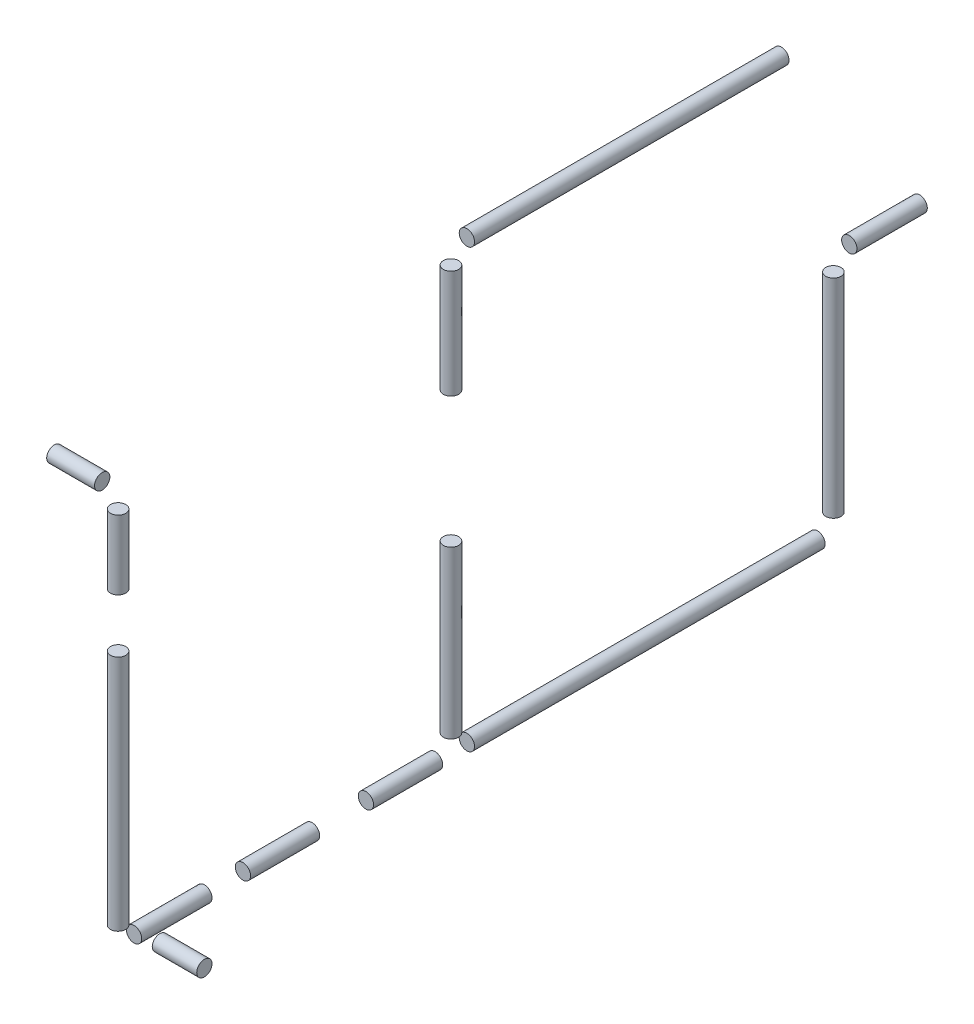
ISO-10303-21;
HEADER;
FILE_DESCRIPTION(('STEP AP214'),'2;1');
FILE_NAME('part.step','',(''),(''),'','','');
FILE_SCHEMA(('AUTOMOTIVE_DESIGN { 1 0 10303 214 1 1 1 1 }'));
ENDSEC;
DATA;
#1=APPLICATION_CONTEXT('core data for automotive mechanical design processes');
#2=APPLICATION_PROTOCOL_DEFINITION('international standard','automotive_design',2000,#1);
#3=PRODUCT_CONTEXT('',#1,'mechanical');
#4=PRODUCT('Part','Part','',(#3));
#5=PRODUCT_RELATED_PRODUCT_CATEGORY('part','',(#4));
#6=PRODUCT_DEFINITION_FORMATION('','',#4);
#7=PRODUCT_DEFINITION_CONTEXT('part definition',#1,'design');
#8=PRODUCT_DEFINITION('design','',#6,#7);
#9=PRODUCT_DEFINITION_SHAPE('','',#8);
#10=(LENGTH_UNIT() NAMED_UNIT(*) SI_UNIT(.MILLI.,.METRE.));
#11=(NAMED_UNIT(*) PLANE_ANGLE_UNIT() SI_UNIT($,.RADIAN.));
#12=(NAMED_UNIT(*) SI_UNIT($,.STERADIAN.) SOLID_ANGLE_UNIT());
#13=UNCERTAINTY_MEASURE_WITH_UNIT(LENGTH_MEASURE(1.E-05),#10,'distance_accuracy_value','');
#14=(GEOMETRIC_REPRESENTATION_CONTEXT(3) GLOBAL_UNCERTAINTY_ASSIGNED_CONTEXT((#13)) GLOBAL_UNIT_ASSIGNED_CONTEXT((#10,
#11,#12)) REPRESENTATION_CONTEXT('',''));
#15=CARTESIAN_POINT('',(0.,0.,0.));
#16=DIRECTION('',(0.,0.,1.));
#17=DIRECTION('',(1.,0.,0.));
#18=AXIS2_PLACEMENT_3D('',#15,#16,#17);
#19=CARTESIAN_POINT('',(-106.981509373988,-37.1926464369301,527.791901869104));
#20=DIRECTION('',(1.,0.,0.));
#21=DIRECTION('',(0.,0.,-1.));
#22=AXIS2_PLACEMENT_3D('',#19,#20,#21);
#23=CYLINDRICAL_SURFACE('',#22,6.35000000036741);
#24=CARTESIAN_POINT('',(-89.0209971308104,-37.1926464369301,527.791901869104));
#25=DIRECTION('',(1.,0.,0.));
#26=DIRECTION('',(0.,1.,0.));
#27=AXIS2_PLACEMENT_3D('',#24,#25,#26);
#28=CIRCLE('',#27,6.35000000036741);
#29=CARTESIAN_POINT('',(-89.0209971308104,-30.8426464365627,527.791901869104));
#30=VERTEX_POINT('',#29);
#31=EDGE_CURVE('E11',#30,#30,#28,.F.);
#32=ORIENTED_EDGE('',*,*,#31,.F.);
#33=EDGE_LOOP('',(#32));
#34=FACE_BOUND('',#33,.T.);
#35=CARTESIAN_POINT('',(-49.2760000000003,-37.1926464369301,527.791901869104));
#36=DIRECTION('',(1.,0.,0.));
#37=DIRECTION('',(0.,0.,-1.));
#38=AXIS2_PLACEMENT_3D('',#35,#36,#37);
#39=CIRCLE('',#38,6.35000000036741);
#40=CARTESIAN_POINT('',(-49.2760000000003,-37.1926464369301,521.441901868736));
#41=VERTEX_POINT('',#40);
#42=EDGE_CURVE('E52',#41,#41,#39,.T.);
#43=ORIENTED_EDGE('',*,*,#42,.F.);
#44=EDGE_LOOP('',(#43));
#45=FACE_BOUND('',#44,.T.);
#46=ADVANCED_FACE('F46',(#34,#45),#23,.T.);
#47=CARTESIAN_POINT('',(-49.2760000000003,-37.1926464369301,527.791901869104));
#48=DIRECTION('',(1.,0.,0.));
#49=DIRECTION('',(0.,0.,-1.));
#50=AXIS2_PLACEMENT_3D('',#47,#48,#49);
#51=PLANE('',#50);
#52=ORIENTED_EDGE('',*,*,#42,.T.);
#53=EDGE_LOOP('',(#52));
#54=FACE_BOUND('',#53,.T.);
#55=ADVANCED_FACE('F58',(#54),#51,.T.);
#56=CARTESIAN_POINT('',(-89.0209971308104,0.,0.));
#57=DIRECTION('',(1.,0.,0.));
#58=DIRECTION('',(0.,1.,0.));
#59=AXIS2_PLACEMENT_3D('',#56,#57,#58);
#60=PLANE('',#59);
#61=ORIENTED_EDGE('',*,*,#31,.T.);
#62=EDGE_LOOP('',(#61));
#63=FACE_BOUND('',#62,.T.);
#64=ADVANCED_FACE('F65',(#63),#60,.F.);
#65=CLOSED_SHELL('',(#46,#55,#64));
#66=MANIFOLD_SOLID_BREP('B2',#65);
#67=CARTESIAN_POINT('',(-36.0679999999031,-32.4401341947649,527.791901869104));
#68=DIRECTION('',(0.,-1.,0.));
#69=DIRECTION('',(1.,0.,0.));
#70=AXIS2_PLACEMENT_3D('',#67,#68,#69);
#71=CYLINDRICAL_SURFACE('',#70,6.3499999999807);
#72=CARTESIAN_POINT('',(-36.0679999999031,-107.804646436848,527.791901869104));
#73=DIRECTION('',(0.,1.,0.));
#74=DIRECTION('',(-1.,0.,0.));
#75=AXIS2_PLACEMENT_3D('',#72,#73,#74);
#76=CIRCLE('',#75,6.3499999999807);
#77=CARTESIAN_POINT('',(-42.4179999998838,-107.804646436848,527.791901869104));
#78=VERTEX_POINT('',#77);
#79=EDGE_CURVE('E102',#78,#78,#76,.T.);
#80=ORIENTED_EDGE('',*,*,#79,.T.);
#81=EDGE_LOOP('',(#80));
#82=FACE_BOUND('',#81,.T.);
#83=CARTESIAN_POINT('',(-36.0679999999031,-50.4006464368485,527.791901869104));
#84=DIRECTION('',(0.,1.,0.));
#85=DIRECTION('',(0.,0.,1.));
#86=AXIS2_PLACEMENT_3D('',#83,#84,#85);
#87=CIRCLE('',#86,6.3499999999807);
#88=CARTESIAN_POINT('',(-36.0679999999031,-50.4006464368485,534.141901869084));
#89=VERTEX_POINT('',#88);
#90=EDGE_CURVE('E45',#89,#89,#87,.T.);
#91=ORIENTED_EDGE('',*,*,#90,.F.);
#92=EDGE_LOOP('',(#91));
#93=FACE_BOUND('',#92,.T.);
#94=ADVANCED_FACE('F95',(#82,#93),#71,.T.);
#95=CARTESIAN_POINT('',(-36.0679999999031,-107.804646436848,527.791901869104));
#96=DIRECTION('',(0.,1.,0.));
#97=DIRECTION('',(-1.,0.,0.));
#98=AXIS2_PLACEMENT_3D('',#95,#96,#97);
#99=PLANE('',#98);
#100=ORIENTED_EDGE('',*,*,#79,.F.);
#101=EDGE_LOOP('',(#100));
#102=FACE_BOUND('',#101,.T.);
#103=ADVANCED_FACE('F110',(#102),#99,.F.);
#104=CARTESIAN_POINT('',(5.69656620990656E-11,-50.4006464368485,0.));
#105=DIRECTION('',(0.,1.,0.));
#106=DIRECTION('',(0.,0.,1.));
#107=AXIS2_PLACEMENT_3D('',#104,#105,#106);
#108=PLANE('',#107);
#109=ORIENTED_EDGE('',*,*,#90,.T.);
#110=EDGE_LOOP('',(#109));
#111=FACE_BOUND('',#110,.T.);
#112=ADVANCED_FACE('F97',(#111),#108,.T.);
#113=CLOSED_SHELL('',(#94,#103,#112));
#114=MANIFOLD_SOLID_BREP('B6',#113);
#115=CARTESIAN_POINT('',(-36.0679999996054,-349.612646436849,527.791901869104));
#116=DIRECTION('',(0.,1.,0.));
#117=DIRECTION('',(0.,0.,1.));
#118=AXIS2_PLACEMENT_3D('',#115,#116,#117);
#119=PLANE('',#118);
#120=CARTESIAN_POINT('',(-36.0679999996054,-349.612646436849,527.791901869104));
#121=DIRECTION('',(0.,1.,0.));
#122=DIRECTION('',(0.,0.,1.));
#123=AXIS2_PLACEMENT_3D('',#120,#121,#122);
#124=CIRCLE('',#123,6.34999999998065);
#125=CARTESIAN_POINT('',(-36.0679999996054,-349.612646436849,534.141901869084));
#126=VERTEX_POINT('',#125);
#127=EDGE_CURVE('E151',#126,#126,#124,.T.);
#128=ORIENTED_EDGE('',*,*,#127,.F.);
#129=EDGE_LOOP('',(#128));
#130=FACE_BOUND('',#129,.T.);
#131=ADVANCED_FACE('F144',(#130),#119,.F.);
#132=CARTESIAN_POINT('',(-36.0679999996054,-134.548134194765,527.791901869104));
#133=DIRECTION('',(0.,-1.,0.));
#134=DIRECTION('',(0.,0.,-1.));
#135=AXIS2_PLACEMENT_3D('',#132,#133,#134);
#136=CYLINDRICAL_SURFACE('',#135,6.34999999998065);
#137=CARTESIAN_POINT('',(-36.0679999996054,-152.508646436849,527.791901869104));
#138=DIRECTION('',(0.,-1.,0.));
#139=DIRECTION('',(0.,0.,-1.));
#140=AXIS2_PLACEMENT_3D('',#137,#138,#139);
#141=CIRCLE('',#140,6.34999999998065);
#142=CARTESIAN_POINT('',(-36.0679999996054,-152.508646436849,521.441901869123));
#143=VERTEX_POINT('',#142);
#144=EDGE_CURVE('E94',#143,#143,#141,.T.);
#145=ORIENTED_EDGE('',*,*,#144,.T.);
#146=EDGE_LOOP('',(#145));
#147=FACE_BOUND('',#146,.T.);
#148=ORIENTED_EDGE('',*,*,#127,.T.);
#149=EDGE_LOOP('',(#148));
#150=FACE_BOUND('',#149,.T.);
#151=ADVANCED_FACE('F146',(#147,#150),#136,.T.);
#152=CARTESIAN_POINT('',(1.7230553522848E-10,-152.508646436849,0.));
#153=DIRECTION('',(0.,-1.,0.));
#154=DIRECTION('',(0.,0.,-1.));
#155=AXIS2_PLACEMENT_3D('',#152,#153,#154);
#156=PLANE('',#155);
#157=ORIENTED_EDGE('',*,*,#144,.F.);
#158=EDGE_LOOP('',(#157));
#159=FACE_BOUND('',#158,.T.);
#160=ADVANCED_FACE('F162',(#159),#156,.F.);
#161=CLOSED_SHELL('',(#131,#151,#160));
#162=MANIFOLD_SOLID_BREP('B40',#161);
#163=CARTESIAN_POINT('',(-36.0679999995904,-362.820646436889,532.544414112398));
#164=DIRECTION('',(0.,0.,-1.));
#165=DIRECTION('',(-1.,0.,0.));
#166=AXIS2_PLACEMENT_3D('',#163,#164,#165);
#167=CYLINDRICAL_SURFACE('',#166,6.35000000040867);
#168=CARTESIAN_POINT('',(-36.0679999995904,-362.820646436889,456.163901869103));
#169=DIRECTION('',(0.,0.,1.));
#170=DIRECTION('',(1.,0.,0.));
#171=AXIS2_PLACEMENT_3D('',#168,#169,#170);
#172=CIRCLE('',#171,6.35000000040867);
#173=CARTESIAN_POINT('',(-42.4179999999991,-362.820646436889,456.163901869103));
#174=VERTEX_POINT('',#173);
#175=EDGE_CURVE('E200',#174,#174,#172,.T.);
#176=CARTESIAN_POINT('',(-36.0679999995904,-362.820646436889,514.583901869103));
#177=DIRECTION('',(0.,0.,1.));
#178=DIRECTION('',(1.,0.,0.));
#179=AXIS2_PLACEMENT_3D('',#176,#177,#178);
#180=CIRCLE('',#179,6.35000000040867);
#181=CARTESIAN_POINT('',(-42.4179999999991,-362.820646436889,514.583901869103));
#182=VERTEX_POINT('',#181);
#183=EDGE_CURVE('E143',#182,#182,#180,.T.);
#184=CARTESIAN_POINT('',(-42.4179999999991,-362.820646436889,456.163901869103));
#185=CARTESIAN_POINT('',(-42.4179999999991,-362.820646436889,456.77244353577));
#186=CARTESIAN_POINT('',(-42.4179999999991,-362.820646436889,457.380985202437));
#187=CARTESIAN_POINT('',(-42.4179999999991,-362.820646436889,458.59806853577));
#188=CARTESIAN_POINT('',(-42.4179999999991,-362.820646436889,459.206610202437));
#189=CARTESIAN_POINT('',(-42.4179999999991,-362.820646436889,460.42369353577));
#190=CARTESIAN_POINT('',(-42.4179999999991,-362.820646436889,461.032235202437));
#191=CARTESIAN_POINT('',(-42.4179999999991,-362.820646436889,462.24931853577));
#192=CARTESIAN_POINT('',(-42.4179999999991,-362.820646436889,462.857860202437));
#193=CARTESIAN_POINT('',(-42.4179999999991,-362.820646436889,464.07494353577));
#194=CARTESIAN_POINT('',(-42.4179999999991,-362.820646436889,464.683485202437));
#195=CARTESIAN_POINT('',(-42.4179999999991,-362.820646436889,465.90056853577));
#196=CARTESIAN_POINT('',(-42.4179999999991,-362.820646436889,466.509110202437));
#197=CARTESIAN_POINT('',(-42.4179999999991,-362.820646436889,467.72619353577));
#198=CARTESIAN_POINT('',(-42.4179999999991,-362.820646436889,468.334735202437));
#199=CARTESIAN_POINT('',(-42.4179999999991,-362.820646436889,469.55181853577));
#200=CARTESIAN_POINT('',(-42.4179999999991,-362.820646436889,470.160360202437));
#201=CARTESIAN_POINT('',(-42.4179999999991,-362.820646436889,471.37744353577));
#202=CARTESIAN_POINT('',(-42.4179999999991,-362.820646436889,471.985985202437));
#203=CARTESIAN_POINT('',(-42.4179999999991,-362.820646436889,473.20306853577));
#204=CARTESIAN_POINT('',(-42.4179999999991,-362.820646436889,473.811610202437));
#205=CARTESIAN_POINT('',(-42.4179999999991,-362.820646436889,475.02869353577));
#206=CARTESIAN_POINT('',(-42.4179999999991,-362.820646436889,475.637235202437));
#207=CARTESIAN_POINT('',(-42.4179999999991,-362.820646436889,476.85431853577));
#208=CARTESIAN_POINT('',(-42.4179999999991,-362.820646436889,477.462860202437));
#209=CARTESIAN_POINT('',(-42.4179999999991,-362.820646436889,478.67994353577));
#210=CARTESIAN_POINT('',(-42.4179999999991,-362.820646436889,479.288485202437));
#211=CARTESIAN_POINT('',(-42.4179999999991,-362.820646436889,480.50556853577));
#212=CARTESIAN_POINT('',(-42.4179999999991,-362.820646436889,481.114110202437));
#213=CARTESIAN_POINT('',(-42.4179999999991,-362.820646436889,482.33119353577));
#214=CARTESIAN_POINT('',(-42.4179999999991,-362.820646436889,482.939735202437));
#215=CARTESIAN_POINT('',(-42.4179999999991,-362.820646436889,484.15681853577));
#216=CARTESIAN_POINT('',(-42.4179999999991,-362.820646436889,484.765360202437));
#217=CARTESIAN_POINT('',(-42.4179999999991,-362.820646436889,485.98244353577));
#218=CARTESIAN_POINT('',(-42.4179999999991,-362.820646436889,486.590985202437));
#219=CARTESIAN_POINT('',(-42.4179999999991,-362.820646436889,487.80806853577));
#220=CARTESIAN_POINT('',(-42.4179999999991,-362.820646436889,488.416610202437));
#221=CARTESIAN_POINT('',(-42.4179999999991,-362.820646436889,489.63369353577));
#222=CARTESIAN_POINT('',(-42.4179999999991,-362.820646436889,490.242235202437));
#223=CARTESIAN_POINT('',(-42.4179999999991,-362.820646436889,491.45931853577));
#224=CARTESIAN_POINT('',(-42.4179999999991,-362.820646436889,492.067860202437));
#225=CARTESIAN_POINT('',(-42.4179999999991,-362.820646436889,493.28494353577));
#226=CARTESIAN_POINT('',(-42.4179999999991,-362.820646436889,493.893485202437));
#227=CARTESIAN_POINT('',(-42.4179999999991,-362.820646436889,495.11056853577));
#228=CARTESIAN_POINT('',(-42.4179999999991,-362.820646436889,495.719110202437));
#229=CARTESIAN_POINT('',(-42.4179999999991,-362.820646436889,496.93619353577));
#230=CARTESIAN_POINT('',(-42.4179999999991,-362.820646436889,497.544735202437));
#231=CARTESIAN_POINT('',(-42.4179999999991,-362.820646436889,498.76181853577));
#232=CARTESIAN_POINT('',(-42.4179999999991,-362.820646436889,499.370360202437));
#233=CARTESIAN_POINT('',(-42.4179999999991,-362.820646436889,500.58744353577));
#234=CARTESIAN_POINT('',(-42.4179999999991,-362.820646436889,501.195985202437));
#235=CARTESIAN_POINT('',(-42.4179999999991,-362.820646436889,502.41306853577));
#236=CARTESIAN_POINT('',(-42.4179999999991,-362.820646436889,503.021610202437));
#237=CARTESIAN_POINT('',(-42.4179999999991,-362.820646436889,504.23869353577));
#238=CARTESIAN_POINT('',(-42.4179999999991,-362.820646436889,504.847235202437));
#239=CARTESIAN_POINT('',(-42.4179999999991,-362.820646436889,506.06431853577));
#240=CARTESIAN_POINT('',(-42.4179999999991,-362.820646436889,506.672860202437));
#241=CARTESIAN_POINT('',(-42.4179999999991,-362.820646436889,507.88994353577));
#242=CARTESIAN_POINT('',(-42.4179999999991,-362.820646436889,508.498485202437));
#243=CARTESIAN_POINT('',(-42.4179999999991,-362.820646436889,509.71556853577));
#244=CARTESIAN_POINT('',(-42.4179999999991,-362.820646436889,510.324110202437));
#245=CARTESIAN_POINT('',(-42.4179999999991,-362.820646436889,511.54119353577));
#246=CARTESIAN_POINT('',(-42.4179999999991,-362.820646436889,512.149735202437));
#247=CARTESIAN_POINT('',(-42.4179999999991,-362.820646436889,513.36681853577));
#248=CARTESIAN_POINT('',(-42.4179999999991,-362.820646436889,513.975360202437));
#249=CARTESIAN_POINT('',(-42.4179999999991,-362.820646436889,514.583901869103));
#250=B_SPLINE_CURVE_WITH_KNOTS('',3,(#184,#185,#186,#187,#188,#189,#190,#191,#192,#193,#194,
#195,#196,#197,#198,#199,#200,#201,#202,#203,#204,#205,#206,#207,#208,#209,#210,#211,#212,#213,
#214,#215,#216,#217,#218,#219,#220,#221,#222,#223,#224,#225,#226,#227,#228,#229,#230,#231,#232,
#233,#234,#235,#236,#237,#238,#239,#240,#241,#242,#243,#244,#245,#246,#247,#248,#249),
.UNSPECIFIED.,.F.,.F.,(4,2,2,2,2,2,2,2,2,2,2,2,2,2,2,2,2,2,2,2,2,2,2,2,2,2,2,2,2,2,2,2,4),(0.,
1.825625,3.65124999999999,5.47687499999999,7.30250000000004,9.12812499999999,10.95375,12.779375,
14.605,16.430625,18.25625,20.081875,21.9075,23.733125,25.55875,27.384375,29.21,31.035625,
32.86125,34.686875,36.5125,38.338125,40.16375,41.9893750000001,43.815,45.640625,47.46625,
49.291875,51.1175,52.943125,54.76875,56.594375,58.42),.UNSPECIFIED.);
#251=EDGE_CURVE('BSEAM193',#174,#182,#250,.T.);
#252=ORIENTED_EDGE('',*,*,#175,.T.);
#253=ORIENTED_EDGE('',*,*,#183,.F.);
#254=ORIENTED_EDGE('',*,*,#251,.T.);
#255=ORIENTED_EDGE('',*,*,#251,.F.);
#256=EDGE_LOOP('',(#252,#254,#253,#255));
#257=FACE_BOUND('',#256,.T.);
#258=ADVANCED_FACE('F193',(#257),#167,.T.);
#259=CARTESIAN_POINT('',(-36.0679999995904,-362.820646436889,456.163901869103));
#260=DIRECTION('',(0.,0.,1.));
#261=DIRECTION('',(1.,0.,0.));
#262=AXIS2_PLACEMENT_3D('',#259,#260,#261);
#263=PLANE('',#262);
#264=ORIENTED_EDGE('',*,*,#175,.F.);
#265=EDGE_LOOP('',(#264));
#266=FACE_BOUND('',#265,.T.);
#267=ADVANCED_FACE('F208',(#266),#263,.F.);
#268=CARTESIAN_POINT('',(0.,0.,514.583901869103));
#269=DIRECTION('',(0.,0.,1.));
#270=DIRECTION('',(1.,0.,0.));
#271=AXIS2_PLACEMENT_3D('',#268,#269,#270);
#272=PLANE('',#271);
#273=ORIENTED_EDGE('',*,*,#183,.T.);
#274=EDGE_LOOP('',(#273));
#275=FACE_BOUND('',#274,.T.);
#276=ADVANCED_FACE('F195',(#275),#272,.T.);
#277=CLOSED_SHELL('',(#258,#267,#276));
#278=MANIFOLD_SOLID_BREP('B89',#277);
#279=CARTESIAN_POINT('',(-34.1094877568232,-432.403946436949,440.161901869103));
#280=DIRECTION('',(-1.,0.,0.));
#281=DIRECTION('',(0.,0.,1.));
#282=AXIS2_PLACEMENT_3D('',#279,#280,#281);
#283=CYLINDRICAL_SURFACE('',#282,6.35000000036717);
#284=CARTESIAN_POINT('',(-89.0209971308574,-432.403946436949,440.161901869103));
#285=DIRECTION('',(1.,0.,0.));
#286=DIRECTION('',(0.,0.,-1.));
#287=AXIS2_PLACEMENT_3D('',#284,#285,#286);
#288=CIRCLE('',#287,6.35000000036717);
#289=CARTESIAN_POINT('',(-89.0209971308574,-432.403946436949,446.511901869471));
#290=VERTEX_POINT('',#289);
#291=EDGE_CURVE('E249',#290,#290,#288,.T.);
#292=CARTESIAN_POINT('',(-52.0700000000001,-432.403946436949,440.161901869103));
#293=DIRECTION('',(1.,0.,0.));
#294=DIRECTION('',(0.,1.,0.));
#295=AXIS2_PLACEMENT_3D('',#292,#293,#294);
#296=CIRCLE('',#295,6.35000000036717);
#297=CARTESIAN_POINT('',(-52.0700000000001,-432.403946436949,446.511901869471));
#298=VERTEX_POINT('',#297);
#299=EDGE_CURVE('E192',#298,#298,#296,.T.);
#300=CARTESIAN_POINT('',(-89.0209971308574,-432.403946436949,446.511901869471));
#301=CARTESIAN_POINT('',(-88.6360909107443,-432.403946436949,446.511901869471));
#302=CARTESIAN_POINT('',(-88.2511846906312,-432.403946436949,446.511901869471));
#303=CARTESIAN_POINT('',(-87.481372250405,-432.403946436949,446.511901869471));
#304=CARTESIAN_POINT('',(-87.0964660302919,-432.403946436949,446.511901869471));
#305=CARTESIAN_POINT('',(-86.3266535900657,-432.403946436949,446.511901869471));
#306=CARTESIAN_POINT('',(-85.9417473699526,-432.403946436949,446.511901869471));
#307=CARTESIAN_POINT('',(-85.1719349297264,-432.403946436949,446.511901869471));
#308=CARTESIAN_POINT('',(-84.7870287096133,-432.403946436949,446.511901869471));
#309=CARTESIAN_POINT('',(-84.0172162693871,-432.403946436949,446.511901869471));
#310=CARTESIAN_POINT('',(-83.632310049274,-432.403946436949,446.511901869471));
#311=CARTESIAN_POINT('',(-82.8624976090478,-432.403946436949,446.511901869471));
#312=CARTESIAN_POINT('',(-82.4775913889347,-432.403946436949,446.511901869471));
#313=CARTESIAN_POINT('',(-81.7077789487085,-432.403946436949,446.511901869471));
#314=CARTESIAN_POINT('',(-81.3228727285954,-432.403946436949,446.511901869471));
#315=CARTESIAN_POINT('',(-80.5530602883692,-432.403946436949,446.511901869471));
#316=CARTESIAN_POINT('',(-80.1681540682562,-432.403946436949,446.511901869471));
#317=CARTESIAN_POINT('',(-79.39834162803,-432.403946436949,446.511901869471));
#318=CARTESIAN_POINT('',(-79.0134354079168,-432.403946436949,446.511901869471));
#319=CARTESIAN_POINT('',(-78.2436229676907,-432.403946436949,446.511901869471));
#320=CARTESIAN_POINT('',(-77.8587167475776,-432.403946436949,446.511901869471));
#321=CARTESIAN_POINT('',(-77.0889043073514,-432.403946436949,446.511901869471));
#322=CARTESIAN_POINT('',(-76.7039980872383,-432.403946436949,446.511901869471));
#323=CARTESIAN_POINT('',(-75.9341856470121,-432.403946436949,446.511901869471));
#324=CARTESIAN_POINT('',(-75.549279426899,-432.403946436949,446.511901869471));
#325=CARTESIAN_POINT('',(-74.7794669866728,-432.403946436949,446.511901869471));
#326=CARTESIAN_POINT('',(-74.3945607665597,-432.403946436949,446.511901869471));
#327=CARTESIAN_POINT('',(-73.6247483263335,-432.403946436949,446.511901869471));
#328=CARTESIAN_POINT('',(-73.2398421062204,-432.403946436949,446.511901869471));
#329=CARTESIAN_POINT('',(-72.4700296659942,-432.403946436949,446.511901869471));
#330=CARTESIAN_POINT('',(-72.0851234458811,-432.403946436949,446.511901869471));
#331=CARTESIAN_POINT('',(-71.3153110056549,-432.403946436949,446.511901869471));
#332=CARTESIAN_POINT('',(-70.9304047855418,-432.403946436949,446.511901869471));
#333=CARTESIAN_POINT('',(-70.1605923453156,-432.403946436949,446.511901869471));
#334=CARTESIAN_POINT('',(-69.7756861252025,-432.403946436949,446.511901869471));
#335=CARTESIAN_POINT('',(-69.0058736849763,-432.403946436949,446.511901869471));
#336=CARTESIAN_POINT('',(-68.6209674648632,-432.403946436949,446.511901869471));
#337=CARTESIAN_POINT('',(-67.851155024637,-432.403946436949,446.511901869471));
#338=CARTESIAN_POINT('',(-67.4662488045239,-432.403946436949,446.511901869471));
#339=CARTESIAN_POINT('',(-66.6964363642977,-432.403946436949,446.511901869471));
#340=CARTESIAN_POINT('',(-66.3115301441847,-432.403946436949,446.511901869471));
#341=CARTESIAN_POINT('',(-65.5417177039585,-432.403946436949,446.511901869471));
#342=CARTESIAN_POINT('',(-65.1568114838454,-432.403946436949,446.511901869471));
#343=CARTESIAN_POINT('',(-64.3869990436192,-432.403946436949,446.511901869471));
#344=CARTESIAN_POINT('',(-64.0020928235061,-432.403946436949,446.511901869471));
#345=CARTESIAN_POINT('',(-63.2322803832799,-432.403946436949,446.511901869471));
#346=CARTESIAN_POINT('',(-62.8473741631668,-432.403946436949,446.511901869471));
#347=CARTESIAN_POINT('',(-62.0775617229406,-432.403946436949,446.511901869471));
#348=CARTESIAN_POINT('',(-61.6926555028275,-432.403946436949,446.511901869471));
#349=CARTESIAN_POINT('',(-60.9228430626013,-432.403946436949,446.511901869471));
#350=CARTESIAN_POINT('',(-60.5379368424882,-432.403946436949,446.511901869471));
#351=CARTESIAN_POINT('',(-59.768124402262,-432.403946436949,446.511901869471));
#352=CARTESIAN_POINT('',(-59.3832181821489,-432.403946436949,446.511901869471));
#353=CARTESIAN_POINT('',(-58.6134057419227,-432.403946436949,446.511901869471));
#354=CARTESIAN_POINT('',(-58.2284995218096,-432.403946436949,446.511901869471));
#355=CARTESIAN_POINT('',(-57.4586870815834,-432.403946436949,446.511901869471));
#356=CARTESIAN_POINT('',(-57.0737808614703,-432.403946436949,446.511901869471));
#357=CARTESIAN_POINT('',(-56.3039684212441,-432.403946436949,446.511901869471));
#358=CARTESIAN_POINT('',(-55.919062201131,-432.403946436949,446.511901869471));
#359=CARTESIAN_POINT('',(-55.1492497609048,-432.403946436949,446.511901869471));
#360=CARTESIAN_POINT('',(-54.7643435407917,-432.403946436949,446.511901869471));
#361=CARTESIAN_POINT('',(-53.9945311005655,-432.403946436949,446.511901869471));
#362=CARTESIAN_POINT('',(-53.6096248804524,-432.403946436949,446.511901869471));
#363=CARTESIAN_POINT('',(-52.8398124402263,-432.403946436949,446.511901869471));
#364=CARTESIAN_POINT('',(-52.4549062201132,-432.403946436949,446.511901869471));
#365=CARTESIAN_POINT('',(-52.0700000000001,-432.403946436949,446.511901869471));
#366=B_SPLINE_CURVE_WITH_KNOTS('',3,(#300,#301,#302,#303,#304,#305,#306,#307,#308,#309,#310,
#311,#312,#313,#314,#315,#316,#317,#318,#319,#320,#321,#322,#323,#324,#325,#326,#327,#328,#329,
#330,#331,#332,#333,#334,#335,#336,#337,#338,#339,#340,#341,#342,#343,#344,#345,#346,#347,#348,
#349,#350,#351,#352,#353,#354,#355,#356,#357,#358,#359,#360,#361,#362,#363,#364,#365),
.UNSPECIFIED.,.F.,.F.,(4,2,2,2,2,2,2,2,2,2,2,2,2,2,2,2,2,2,2,2,2,2,2,2,2,2,2,2,2,2,2,2,4),(0.,
1.15471866033928,2.30943732067858,3.46415598101787,4.61887464135716,5.77359330169644,
6.92831196203575,8.08303062237503,9.23774928271431,10.3924679430536,11.5471866033929,
12.7019052637322,13.8566239240715,15.0113425844108,16.1660612447501,17.3207799050894,
18.4754985654287,19.6302172257679,20.7849358861072,21.9396545464465,23.0943732067858,
24.2490918671251,25.4038105274644,26.5585291878037,27.713247848143,28.8679665084823,
30.0226851688216,31.1774038291609,32.3321224895002,33.4868411498394,34.6415598101787,
35.796278470518,36.9509971308573),.UNSPECIFIED.);
#367=EDGE_CURVE('BSEAM242',#290,#298,#366,.T.);
#368=ORIENTED_EDGE('',*,*,#291,.T.);
#369=ORIENTED_EDGE('',*,*,#299,.F.);
#370=ORIENTED_EDGE('',*,*,#367,.T.);
#371=ORIENTED_EDGE('',*,*,#367,.F.);
#372=EDGE_LOOP('',(#368,#370,#369,#371));
#373=FACE_BOUND('',#372,.T.);
#374=ADVANCED_FACE('F242',(#373),#283,.T.);
#375=CARTESIAN_POINT('',(-89.0209971308574,-432.403946436949,440.161901869103));
#376=DIRECTION('',(1.,0.,0.));
#377=DIRECTION('',(0.,0.,-1.));
#378=AXIS2_PLACEMENT_3D('',#375,#376,#377);
#379=PLANE('',#378);
#380=ORIENTED_EDGE('',*,*,#291,.F.);
#381=EDGE_LOOP('',(#380));
#382=FACE_BOUND('',#381,.T.);
#383=ADVANCED_FACE('F257',(#382),#379,.F.);
#384=CARTESIAN_POINT('',(-52.0700000000005,-5.88495431255846E-11,0.));
#385=DIRECTION('',(1.,0.,0.));
#386=DIRECTION('',(0.,1.,0.));
#387=AXIS2_PLACEMENT_3D('',#384,#385,#386);
#388=PLANE('',#387);
#389=ORIENTED_EDGE('',*,*,#299,.T.);
#390=EDGE_LOOP('',(#389));
#391=FACE_BOUND('',#390,.T.);
#392=ADVANCED_FACE('F244',(#391),#388,.T.);
#393=CLOSED_SHELL('',(#374,#383,#392));
#394=MANIFOLD_SOLID_BREP('B138',#393);
#395=CARTESIAN_POINT('',(-36.06799999959,-362.820646436889,442.120414112396));
#396=DIRECTION('',(0.,0.,-1.));
#397=DIRECTION('',(-1.,0.,0.));
#398=AXIS2_PLACEMENT_3D('',#395,#396,#397);
#399=CYLINDRICAL_SURFACE('',#398,6.35000000040821);
#400=CARTESIAN_POINT('',(-36.06799999959,-362.820646436889,366.755901869103));
#401=DIRECTION('',(0.,0.,1.));
#402=DIRECTION('',(1.,0.,0.));
#403=AXIS2_PLACEMENT_3D('',#400,#401,#402);
#404=CIRCLE('',#403,6.35000000040821);
#405=CARTESIAN_POINT('',(-29.7179999991818,-362.820646436889,366.755901869103));
#406=VERTEX_POINT('',#405);
#407=EDGE_CURVE('E298',#406,#406,#404,.T.);
#408=ORIENTED_EDGE('',*,*,#407,.T.);
#409=EDGE_LOOP('',(#408));
#410=FACE_BOUND('',#409,.T.);
#411=CARTESIAN_POINT('',(-36.06799999959,-362.820646436889,424.159901869103));
#412=DIRECTION('',(0.,0.,1.));
#413=DIRECTION('',(1.,0.,0.));
#414=AXIS2_PLACEMENT_3D('',#411,#412,#413);
#415=CIRCLE('',#414,6.35000000040821);
#416=CARTESIAN_POINT('',(-29.7179999991818,-362.820646436889,424.159901869103));
#417=VERTEX_POINT('',#416);
#418=EDGE_CURVE('E241',#417,#417,#415,.T.);
#419=ORIENTED_EDGE('',*,*,#418,.F.);
#420=EDGE_LOOP('',(#419));
#421=FACE_BOUND('',#420,.T.);
#422=ADVANCED_FACE('F291',(#410,#421),#399,.T.);
#423=CARTESIAN_POINT('',(-36.06799999959,-362.820646436889,366.755901869103));
#424=DIRECTION('',(0.,0.,1.));
#425=DIRECTION('',(1.,0.,0.));
#426=AXIS2_PLACEMENT_3D('',#423,#424,#425);
#427=PLANE('',#426);
#428=ORIENTED_EDGE('',*,*,#407,.F.);
#429=EDGE_LOOP('',(#428));
#430=FACE_BOUND('',#429,.T.);
#431=ADVANCED_FACE('F306',(#430),#427,.F.);
#432=CARTESIAN_POINT('',(0.,0.,424.159901869103));
#433=DIRECTION('',(0.,0.,1.));
#434=DIRECTION('',(1.,0.,0.));
#435=AXIS2_PLACEMENT_3D('',#432,#433,#434);
#436=PLANE('',#435);
#437=ORIENTED_EDGE('',*,*,#418,.T.);
#438=EDGE_LOOP('',(#437));
#439=FACE_BOUND('',#438,.T.);
#440=ADVANCED_FACE('F293',(#439),#436,.T.);
#441=CLOSED_SHELL('',(#422,#431,#440));
#442=MANIFOLD_SOLID_BREP('B187',#441);
#443=CARTESIAN_POINT('',(-36.0679999995904,-362.820646435492,340.012414111242));
#444=DIRECTION('',(0.,0.,-1.));
#445=DIRECTION('',(-1.,0.,0.));
#446=AXIS2_PLACEMENT_3D('',#443,#444,#445);
#447=CYLINDRICAL_SURFACE('',#446,6.35000000000002);
#448=CARTESIAN_POINT('',(-36.0679999995904,-362.820646435492,264.647901869147));
#449=DIRECTION('',(0.,0.,1.));
#450=DIRECTION('',(1.,0.,0.));
#451=AXIS2_PLACEMENT_3D('',#448,#449,#450);
#452=CIRCLE('',#451,6.35000000000002);
#453=CARTESIAN_POINT('',(-29.7179999995904,-362.820646435492,264.647901869147));
#454=VERTEX_POINT('',#453);
#455=EDGE_CURVE('E347',#454,#454,#452,.T.);
#456=ORIENTED_EDGE('',*,*,#455,.T.);
#457=EDGE_LOOP('',(#456));
#458=FACE_BOUND('',#457,.T.);
#459=CARTESIAN_POINT('',(-36.0679999995904,-362.820646435492,322.051901869103));
#460=DIRECTION('',(0.,0.,1.));
#461=DIRECTION('',(1.,0.,0.));
#462=AXIS2_PLACEMENT_3D('',#459,#460,#461);
#463=CIRCLE('',#462,6.35000000000002);
#464=CARTESIAN_POINT('',(-29.7179999995904,-362.820646435492,322.051901869103));
#465=VERTEX_POINT('',#464);
#466=EDGE_CURVE('E290',#465,#465,#463,.T.);
#467=ORIENTED_EDGE('',*,*,#466,.F.);
#468=EDGE_LOOP('',(#467));
#469=FACE_BOUND('',#468,.T.);
#470=ADVANCED_FACE('F340',(#458,#469),#447,.T.);
#471=CARTESIAN_POINT('',(-36.0679999995904,-362.820646435492,264.647901869147));
#472=DIRECTION('',(0.,0.,1.));
#473=DIRECTION('',(1.,0.,0.));
#474=AXIS2_PLACEMENT_3D('',#471,#472,#473);
#475=PLANE('',#474);
#476=ORIENTED_EDGE('',*,*,#455,.F.);
#477=EDGE_LOOP('',(#476));
#478=FACE_BOUND('',#477,.T.);
#479=ADVANCED_FACE('F355',(#478),#475,.F.);
#480=CARTESIAN_POINT('',(0.,0.,322.051901869103));
#481=DIRECTION('',(0.,0.,1.));
#482=DIRECTION('',(1.,0.,0.));
#483=AXIS2_PLACEMENT_3D('',#480,#481,#482);
#484=PLANE('',#483);
#485=ORIENTED_EDGE('',*,*,#466,.T.);
#486=EDGE_LOOP('',(#485));
#487=FACE_BOUND('',#486,.T.);
#488=ADVANCED_FACE('F342',(#487),#484,.T.);
#489=CLOSED_SHELL('',(#470,#479,#488));
#490=MANIFOLD_SOLID_BREP('B236',#489);
#491=CARTESIAN_POINT('',(-36.0679999998155,-163.684646435492,-155.648610373035));
#492=DIRECTION('',(0.,0.,1.));
#493=DIRECTION('',(1.,0.,0.));
#494=AXIS2_PLACEMENT_3D('',#491,#492,#493);
#495=CYLINDRICAL_SURFACE('',#494,6.35);
#496=CARTESIAN_POINT('',(-36.0679999998155,-163.684646435492,-137.688098130897));
#497=DIRECTION('',(0.,0.,1.));
#498=DIRECTION('',(1.,0.,0.));
#499=AXIS2_PLACEMENT_3D('',#496,#497,#498);
#500=CIRCLE('',#499,6.35);
#501=CARTESIAN_POINT('',(-29.7179999998155,-163.684646435492,-137.688098130897));
#502=VERTEX_POINT('',#501);
#503=EDGE_CURVE('E339',#502,#502,#500,.F.);
#504=ORIENTED_EDGE('',*,*,#503,.F.);
#505=EDGE_LOOP('',(#504));
#506=FACE_BOUND('',#505,.T.);
#507=CARTESIAN_POINT('',(-36.0679999998155,-163.684646435492,-79.2680981308534));
#508=DIRECTION('',(0.,0.,1.));
#509=DIRECTION('',(1.,0.,0.));
#510=AXIS2_PLACEMENT_3D('',#507,#508,#509);
#511=CIRCLE('',#510,6.35);
#512=CARTESIAN_POINT('',(-29.7179999998155,-163.684646435492,-79.2680981308534));
#513=VERTEX_POINT('',#512);
#514=EDGE_CURVE('E395',#513,#513,#511,.T.);
#515=ORIENTED_EDGE('',*,*,#514,.F.);
#516=EDGE_LOOP('',(#515));
#517=FACE_BOUND('',#516,.T.);
#518=ADVANCED_FACE('F389',(#506,#517),#495,.T.);
#519=CARTESIAN_POINT('',(-36.0679999998155,-163.684646435492,-79.2680981308534));
#520=DIRECTION('',(0.,0.,1.));
#521=DIRECTION('',(1.,0.,0.));
#522=AXIS2_PLACEMENT_3D('',#519,#520,#521);
#523=PLANE('',#522);
#524=ORIENTED_EDGE('',*,*,#514,.T.);
#525=EDGE_LOOP('',(#524));
#526=FACE_BOUND('',#525,.T.);
#527=ADVANCED_FACE('F401',(#526),#523,.T.);
#528=CARTESIAN_POINT('',(0.,0.,-137.688098130897));
#529=DIRECTION('',(0.,0.,1.));
#530=DIRECTION('',(1.,0.,0.));
#531=AXIS2_PLACEMENT_3D('',#528,#529,#530);
#532=PLANE('',#531);
#533=ORIENTED_EDGE('',*,*,#503,.T.);
#534=EDGE_LOOP('',(#533));
#535=FACE_BOUND('',#534,.T.);
#536=ADVANCED_FACE('F408',(#535),#532,.F.);
#537=CLOSED_SHELL('',(#518,#527,#536));
#538=MANIFOLD_SOLID_BREP('B285',#537);
#539=CARTESIAN_POINT('',(-36.0679999996053,-349.612646436849,-66.0600981308967));
#540=DIRECTION('',(0.,1.,0.));
#541=DIRECTION('',(0.,0.,1.));
#542=AXIS2_PLACEMENT_3D('',#539,#540,#541);
#543=PLANE('',#542);
#544=CARTESIAN_POINT('',(-36.0679999996053,-349.612646436849,-66.0600981308967));
#545=DIRECTION('',(0.,1.,0.));
#546=DIRECTION('',(0.,0.,1.));
#547=AXIS2_PLACEMENT_3D('',#544,#545,#546);
#548=CIRCLE('',#547,6.34999999998066);
#549=CARTESIAN_POINT('',(-36.0679999996053,-349.612646436849,-59.7100981309161));
#550=VERTEX_POINT('',#549);
#551=EDGE_CURVE('E445',#550,#550,#548,.T.);
#552=ORIENTED_EDGE('',*,*,#551,.F.);
#553=EDGE_LOOP('',(#552));
#554=FACE_BOUND('',#553,.T.);
#555=ADVANCED_FACE('F438',(#554),#543,.F.);
#556=CARTESIAN_POINT('',(-36.0679999996053,-158.932134193367,-66.0600981308967));
#557=DIRECTION('',(0.,-1.,0.));
#558=DIRECTION('',(0.,0.,-1.));
#559=AXIS2_PLACEMENT_3D('',#556,#557,#558);
#560=CYLINDRICAL_SURFACE('',#559,6.34999999998066);
#561=CARTESIAN_POINT('',(-36.0679999996053,-176.892646435451,-66.0600981308967));
#562=DIRECTION('',(0.,-1.,0.));
#563=DIRECTION('',(1.,0.,0.));
#564=AXIS2_PLACEMENT_3D('',#561,#562,#563);
#565=CIRCLE('',#564,6.34999999998066);
#566=CARTESIAN_POINT('',(-29.7179999996246,-176.892646435451,-66.0600981308967));
#567=VERTEX_POINT('',#566);
#568=EDGE_CURVE('E388',#567,#567,#565,.T.);
#569=ORIENTED_EDGE('',*,*,#568,.T.);
#570=EDGE_LOOP('',(#569));
#571=FACE_BOUND('',#570,.T.);
#572=ORIENTED_EDGE('',*,*,#551,.T.);
#573=EDGE_LOOP('',(#572));
#574=FACE_BOUND('',#573,.T.);
#575=ADVANCED_FACE('F440',(#571,#574),#560,.T.);
#576=CARTESIAN_POINT('',(2.00061385194962E-10,-176.892646435451,0.));
#577=DIRECTION('',(0.,-1.,0.));
#578=DIRECTION('',(1.,0.,0.));
#579=AXIS2_PLACEMENT_3D('',#576,#577,#578);
#580=PLANE('',#579);
#581=ORIENTED_EDGE('',*,*,#568,.F.);
#582=EDGE_LOOP('',(#581));
#583=FACE_BOUND('',#582,.T.);
#584=ADVANCED_FACE('F456',(#583),#580,.F.);
#585=CLOSED_SHELL('',(#555,#575,#584));
#586=MANIFOLD_SOLID_BREP('B334',#585);
#587=CARTESIAN_POINT('',(-36.0679999995905,-362.820646436889,-70.8126103741476));
#588=DIRECTION('',(0.,0.,1.));
#589=DIRECTION('',(1.,0.,0.));
#590=AXIS2_PLACEMENT_3D('',#587,#588,#589);
#591=CYLINDRICAL_SURFACE('',#590,6.35000000040868);
#592=CARTESIAN_POINT('',(-36.0679999995905,-362.820646436889,-52.8520981308534));
#593=DIRECTION('',(0.,0.,1.));
#594=DIRECTION('',(1.,0.,0.));
#595=AXIS2_PLACEMENT_3D('',#592,#593,#594);
#596=CIRCLE('',#595,6.35000000040868);
#597=CARTESIAN_POINT('',(-29.7179999991818,-362.820646436889,-52.8520981308534));
#598=VERTEX_POINT('',#597);
#599=EDGE_CURVE('E437',#598,#598,#596,.F.);
#600=ORIENTED_EDGE('',*,*,#599,.F.);
#601=EDGE_LOOP('',(#600));
#602=FACE_BOUND('',#601,.T.);
#603=CARTESIAN_POINT('',(-36.0679999995905,-362.820646436889,238.231901869103));
#604=DIRECTION('',(0.,0.,1.));
#605=DIRECTION('',(1.,0.,0.));
#606=AXIS2_PLACEMENT_3D('',#603,#604,#605);
#607=CIRCLE('',#606,6.35000000040868);
#608=CARTESIAN_POINT('',(-29.7179999991818,-362.820646436889,238.231901869103));
#609=VERTEX_POINT('',#608);
#610=EDGE_CURVE('E493',#609,#609,#607,.T.);
#611=ORIENTED_EDGE('',*,*,#610,.F.);
#612=EDGE_LOOP('',(#611));
#613=FACE_BOUND('',#612,.T.);
#614=ADVANCED_FACE('F487',(#602,#613),#591,.T.);
#615=CARTESIAN_POINT('',(-36.0679999995905,-362.820646436889,238.231901869103));
#616=DIRECTION('',(0.,0.,1.));
#617=DIRECTION('',(1.,0.,0.));
#618=AXIS2_PLACEMENT_3D('',#615,#616,#617);
#619=PLANE('',#618);
#620=ORIENTED_EDGE('',*,*,#610,.T.);
#621=EDGE_LOOP('',(#620));
#622=FACE_BOUND('',#621,.T.);
#623=ADVANCED_FACE('F499',(#622),#619,.T.);
#624=CARTESIAN_POINT('',(0.,0.,-52.8520981308534));
#625=DIRECTION('',(0.,0.,1.));
#626=DIRECTION('',(1.,0.,0.));
#627=AXIS2_PLACEMENT_3D('',#624,#625,#626);
#628=PLANE('',#627);
#629=ORIENTED_EDGE('',*,*,#599,.T.);
#630=EDGE_LOOP('',(#629));
#631=FACE_BOUND('',#630,.T.);
#632=ADVANCED_FACE('F506',(#631),#628,.F.);
#633=CLOSED_SHELL('',(#614,#623,#632));
#634=MANIFOLD_SOLID_BREP('B383',#633);
#635=CARTESIAN_POINT('',(3.95759342131527E-10,-349.612646435451,0.));
#636=DIRECTION('',(0.,-1.,0.));
#637=DIRECTION('',(0.,0.,-1.));
#638=AXIS2_PLACEMENT_3D('',#635,#636,#637);
#639=PLANE('',#638);
#640=CARTESIAN_POINT('',(-36.0679999997613,-349.612646435451,251.439901869147));
#641=DIRECTION('',(0.,-1.,0.));
#642=DIRECTION('',(0.,0.,-1.));
#643=AXIS2_PLACEMENT_3D('',#640,#641,#642);
#644=CIRCLE('',#643,6.34999999999345);
#645=CARTESIAN_POINT('',(-36.0679999997613,-349.612646435451,257.78990186914));
#646=VERTEX_POINT('',#645);
#647=EDGE_CURVE('E486',#646,#646,#644,.F.);
#648=ORIENTED_EDGE('',*,*,#647,.F.);
#649=EDGE_LOOP('',(#648));
#650=FACE_BOUND('',#649,.T.);
#651=ADVANCED_FACE('F536',(#650),#639,.T.);
#652=CARTESIAN_POINT('',(-36.0679999997613,-211.639846435451,251.439901869147));
#653=DIRECTION('',(0.,1.,0.));
#654=DIRECTION('',(0.,0.,1.));
#655=AXIS2_PLACEMENT_3D('',#652,#653,#654);
#656=PLANE('',#655);
#657=CARTESIAN_POINT('',(-36.0679999997613,-211.639846435451,251.439901869147));
#658=DIRECTION('',(0.,1.,0.));
#659=DIRECTION('',(0.,0.,1.));
#660=AXIS2_PLACEMENT_3D('',#657,#658,#659);
#661=CIRCLE('',#660,6.34999999999345);
#662=CARTESIAN_POINT('',(-36.0679999997613,-211.639846435451,257.78990186914));
#663=VERTEX_POINT('',#662);
#664=EDGE_CURVE('E542',#663,#663,#661,.T.);
#665=ORIENTED_EDGE('',*,*,#664,.T.);
#666=EDGE_LOOP('',(#665));
#667=FACE_BOUND('',#666,.T.);
#668=ADVANCED_FACE('F548',(#667),#656,.T.);
#669=CARTESIAN_POINT('',(-36.0679999997613,-367.573158677571,251.439901869147));
#670=DIRECTION('',(0.,1.,0.));
#671=DIRECTION('',(0.,0.,1.));
#672=AXIS2_PLACEMENT_3D('',#669,#670,#671);
#673=CYLINDRICAL_SURFACE('',#672,6.34999999999345);
#674=CARTESIAN_POINT('',(-36.0679999997613,-211.639846435451,257.78990186914));
#675=CARTESIAN_POINT('',(-36.0679999997613,-213.077063102118,257.78990186914));
#676=CARTESIAN_POINT('',(-36.0679999997613,-214.514279768784,257.78990186914));
#677=CARTESIAN_POINT('',(-36.0679999997613,-217.388713102118,257.78990186914));
#678=CARTESIAN_POINT('',(-36.0679999997613,-218.825929768784,257.78990186914));
#679=CARTESIAN_POINT('',(-36.0679999997613,-221.700363102118,257.78990186914));
#680=CARTESIAN_POINT('',(-36.0679999997613,-223.137579768784,257.78990186914));
#681=CARTESIAN_POINT('',(-36.0679999997613,-226.012013102118,257.78990186914));
#682=CARTESIAN_POINT('',(-36.0679999997613,-227.449229768784,257.78990186914));
#683=CARTESIAN_POINT('',(-36.0679999997613,-230.323663102118,257.78990186914));
#684=CARTESIAN_POINT('',(-36.0679999997613,-231.760879768784,257.78990186914));
#685=CARTESIAN_POINT('',(-36.0679999997613,-234.635313102118,257.78990186914));
#686=CARTESIAN_POINT('',(-36.0679999997613,-236.072529768784,257.78990186914));
#687=CARTESIAN_POINT('',(-36.0679999997613,-238.946963102118,257.78990186914));
#688=CARTESIAN_POINT('',(-36.0679999997613,-240.384179768784,257.78990186914));
#689=CARTESIAN_POINT('',(-36.0679999997613,-243.258613102118,257.78990186914));
#690=CARTESIAN_POINT('',(-36.0679999997613,-244.695829768784,257.78990186914));
#691=CARTESIAN_POINT('',(-36.0679999997613,-247.570263102118,257.78990186914));
#692=CARTESIAN_POINT('',(-36.0679999997613,-249.007479768784,257.78990186914));
#693=CARTESIAN_POINT('',(-36.0679999997613,-251.881913102118,257.78990186914));
#694=CARTESIAN_POINT('',(-36.0679999997613,-253.319129768784,257.78990186914));
#695=CARTESIAN_POINT('',(-36.0679999997613,-256.193563102118,257.78990186914));
#696=CARTESIAN_POINT('',(-36.0679999997613,-257.630779768784,257.78990186914));
#697=CARTESIAN_POINT('',(-36.0679999997613,-260.505213102118,257.78990186914));
#698=CARTESIAN_POINT('',(-36.0679999997613,-261.942429768784,257.78990186914));
#699=CARTESIAN_POINT('',(-36.0679999997613,-264.816863102118,257.78990186914));
#700=CARTESIAN_POINT('',(-36.0679999997613,-266.254079768784,257.78990186914));
#701=CARTESIAN_POINT('',(-36.0679999997613,-269.128513102118,257.78990186914));
#702=CARTESIAN_POINT('',(-36.0679999997613,-270.565729768784,257.78990186914));
#703=CARTESIAN_POINT('',(-36.0679999997613,-273.440163102118,257.78990186914));
#704=CARTESIAN_POINT('',(-36.0679999997613,-274.877379768784,257.78990186914));
#705=CARTESIAN_POINT('',(-36.0679999997613,-277.751813102118,257.78990186914));
#706=CARTESIAN_POINT('',(-36.0679999997613,-279.189029768784,257.78990186914));
#707=CARTESIAN_POINT('',(-36.0679999997613,-282.063463102118,257.78990186914));
#708=CARTESIAN_POINT('',(-36.0679999997613,-283.500679768784,257.78990186914));
#709=CARTESIAN_POINT('',(-36.0679999997613,-286.375113102118,257.78990186914));
#710=CARTESIAN_POINT('',(-36.0679999997613,-287.812329768784,257.78990186914));
#711=CARTESIAN_POINT('',(-36.0679999997613,-290.686763102118,257.78990186914));
#712=CARTESIAN_POINT('',(-36.0679999997613,-292.123979768784,257.78990186914));
#713=CARTESIAN_POINT('',(-36.0679999997613,-294.998413102118,257.78990186914));
#714=CARTESIAN_POINT('',(-36.0679999997613,-296.435629768784,257.78990186914));
#715=CARTESIAN_POINT('',(-36.0679999997613,-299.310063102118,257.78990186914));
#716=CARTESIAN_POINT('',(-36.0679999997613,-300.747279768784,257.78990186914));
#717=CARTESIAN_POINT('',(-36.0679999997613,-303.621713102118,257.78990186914));
#718=CARTESIAN_POINT('',(-36.0679999997613,-305.058929768784,257.78990186914));
#719=CARTESIAN_POINT('',(-36.0679999997613,-307.933363102118,257.78990186914));
#720=CARTESIAN_POINT('',(-36.0679999997613,-309.370579768784,257.78990186914));
#721=CARTESIAN_POINT('',(-36.0679999997613,-312.245013102118,257.78990186914));
#722=CARTESIAN_POINT('',(-36.0679999997613,-313.682229768784,257.78990186914));
#723=CARTESIAN_POINT('',(-36.0679999997613,-316.556663102118,257.78990186914));
#724=CARTESIAN_POINT('',(-36.0679999997613,-317.993879768784,257.78990186914));
#725=CARTESIAN_POINT('',(-36.0679999997613,-320.868313102117,257.78990186914));
#726=CARTESIAN_POINT('',(-36.0679999997613,-322.305529768784,257.78990186914));
#727=CARTESIAN_POINT('',(-36.0679999997613,-325.179963102117,257.78990186914));
#728=CARTESIAN_POINT('',(-36.0679999997613,-326.617179768784,257.78990186914));
#729=CARTESIAN_POINT('',(-36.0679999997613,-329.491613102118,257.78990186914));
#730=CARTESIAN_POINT('',(-36.0679999997613,-330.928829768784,257.78990186914));
#731=CARTESIAN_POINT('',(-36.0679999997613,-333.803263102118,257.78990186914));
#732=CARTESIAN_POINT('',(-36.0679999997613,-335.240479768784,257.78990186914));
#733=CARTESIAN_POINT('',(-36.0679999997613,-338.114913102117,257.78990186914));
#734=CARTESIAN_POINT('',(-36.0679999997613,-339.552129768784,257.78990186914));
#735=CARTESIAN_POINT('',(-36.0679999997613,-342.426563102117,257.78990186914));
#736=CARTESIAN_POINT('',(-36.0679999997613,-343.863779768784,257.78990186914));
#737=CARTESIAN_POINT('',(-36.0679999997613,-346.738213102117,257.78990186914));
#738=CARTESIAN_POINT('',(-36.0679999997613,-348.175429768784,257.78990186914));
#739=CARTESIAN_POINT('',(-36.0679999997613,-349.612646435451,257.78990186914));
#740=B_SPLINE_CURVE_WITH_KNOTS('',3,(#674,#675,#676,#677,#678,#679,#680,#681,#682,#683,#684,
#685,#686,#687,#688,#689,#690,#691,#692,#693,#694,#695,#696,#697,#698,#699,#700,#701,#702,#703,
#704,#705,#706,#707,#708,#709,#710,#711,#712,#713,#714,#715,#716,#717,#718,#719,#720,#721,#722,
#723,#724,#725,#726,#727,#728,#729,#730,#731,#732,#733,#734,#735,#736,#737,#738,#739),
.UNSPECIFIED.,.F.,.F.,(4,2,2,2,2,2,2,2,2,2,2,2,2,2,2,2,2,2,2,2,2,2,2,2,2,2,2,2,2,2,2,2,4),(0.,
4.31165,8.62329999999997,12.93495,17.2466,21.55825,25.8698999999999,30.1815499999999,
34.4931999999999,38.8048499999999,43.1164999999999,47.4281499999999,51.7397999999999,
56.0514499999999,60.3630999999999,64.6747499999999,68.9863999999999,73.2980499999999,
77.6096999999999,81.9213499999998,86.2329999999998,90.5446499999998,94.8562999999998,
99.1679499999998,103.4796,107.79125,112.1029,116.41455,120.7262,125.03785,129.3495,133.66115,
137.9728),.UNSPECIFIED.);
#741=EDGE_CURVE('BSEAM550',#663,#646,#740,.T.);
#742=ORIENTED_EDGE('',*,*,#664,.F.);
#743=ORIENTED_EDGE('',*,*,#647,.T.);
#744=ORIENTED_EDGE('',*,*,#741,.T.);
#745=ORIENTED_EDGE('',*,*,#741,.F.);
#746=EDGE_LOOP('',(#742,#744,#743,#745));
#747=FACE_BOUND('',#746,.T.);
#748=ADVANCED_FACE('F550',(#747),#673,.T.);
#749=CLOSED_SHELL('',(#651,#668,#748));
#750=MANIFOLD_SOLID_BREP('B432',#749);
#751=CARTESIAN_POINT('',(-36.0679999999851,-121.008358437589,251.439901869171));
#752=DIRECTION('',(0.,1.,0.));
#753=DIRECTION('',(0.,0.,1.));
#754=AXIS2_PLACEMENT_3D('',#751,#752,#753);
#755=CYLINDRICAL_SURFACE('',#754,6.35000000000002);
#756=CARTESIAN_POINT('',(-36.0679999999851,-103.047846195451,251.439901869171));
#757=DIRECTION('',(0.,1.,0.));
#758=DIRECTION('',(0.,0.,1.));
#759=AXIS2_PLACEMENT_3D('',#756,#757,#758);
#760=CIRCLE('',#759,6.35000000000002);
#761=CARTESIAN_POINT('',(-36.0679999999851,-103.047846195451,257.789901869171));
#762=VERTEX_POINT('',#761);
#763=EDGE_CURVE('E535',#762,#762,#760,.F.);
#764=ORIENTED_EDGE('',*,*,#763,.F.);
#765=EDGE_LOOP('',(#764));
#766=FACE_BOUND('',#765,.T.);
#767=CARTESIAN_POINT('',(-36.0679999999851,-13.2079999999592,251.439901869171));
#768=DIRECTION('',(0.,1.,0.));
#769=DIRECTION('',(0.,0.,1.));
#770=AXIS2_PLACEMENT_3D('',#767,#768,#769);
#771=CIRCLE('',#770,6.35000000000002);
#772=CARTESIAN_POINT('',(-36.0679999999851,-13.2079999999592,257.789901869171));
#773=VERTEX_POINT('',#772);
#774=EDGE_CURVE('E591',#773,#773,#771,.T.);
#775=ORIENTED_EDGE('',*,*,#774,.F.);
#776=EDGE_LOOP('',(#775));
#777=FACE_BOUND('',#776,.T.);
#778=ADVANCED_FACE('F585',(#766,#777),#755,.T.);
#779=CARTESIAN_POINT('',(-36.0679999999851,-13.2079999999592,251.439901869171));
#780=DIRECTION('',(0.,1.,0.));
#781=DIRECTION('',(0.,0.,1.));
#782=AXIS2_PLACEMENT_3D('',#779,#780,#781);
#783=PLANE('',#782);
#784=ORIENTED_EDGE('',*,*,#774,.T.);
#785=EDGE_LOOP('',(#784));
#786=FACE_BOUND('',#785,.T.);
#787=ADVANCED_FACE('F597',(#786),#783,.T.);
#788=CARTESIAN_POINT('',(1.16377594914205E-10,-103.047846195451,0.));
#789=DIRECTION('',(0.,1.,0.));
#790=DIRECTION('',(0.,0.,1.));
#791=AXIS2_PLACEMENT_3D('',#788,#789,#790);
#792=PLANE('',#791);
#793=ORIENTED_EDGE('',*,*,#763,.T.);
#794=EDGE_LOOP('',(#793));
#795=FACE_BOUND('',#794,.T.);
#796=ADVANCED_FACE('F604',(#795),#792,.F.);
#797=CLOSED_SHELL('',(#778,#787,#796));
#798=MANIFOLD_SOLID_BREP('B481',#797);
#799=CARTESIAN_POINT('',(0.,0.,238.231901869171));
#800=DIRECTION('',(0.,0.,1.));
#801=DIRECTION('',(1.,0.,0.));
#802=AXIS2_PLACEMENT_3D('',#799,#800,#801);
#803=PLANE('',#802);
#804=CARTESIAN_POINT('',(-36.0679999999998,0.,238.231901869171));
#805=DIRECTION('',(0.,0.,1.));
#806=DIRECTION('',(1.,0.,0.));
#807=AXIS2_PLACEMENT_3D('',#804,#805,#806);
#808=CIRCLE('',#807,6.35000000000006);
#809=CARTESIAN_POINT('',(-29.7179999999998,0.,238.231901869171));
#810=VERTEX_POINT('',#809);
#811=EDGE_CURVE('E584',#810,#810,#808,.F.);
#812=ORIENTED_EDGE('',*,*,#811,.F.);
#813=EDGE_LOOP('',(#812));
#814=FACE_BOUND('',#813,.T.);
#815=ADVANCED_FACE('F634',(#814),#803,.T.);
#816=CARTESIAN_POINT('',(-36.068,0.,-22.86));
#817=DIRECTION('',(0.,0.,-1.));
#818=DIRECTION('',(-1.,0.,0.));
#819=AXIS2_PLACEMENT_3D('',#816,#817,#818);
#820=PLANE('',#819);
#821=CARTESIAN_POINT('',(-36.068,0.,-22.86));
#822=DIRECTION('',(0.,0.,-1.));
#823=DIRECTION('',(-1.,0.,0.));
#824=AXIS2_PLACEMENT_3D('',#821,#822,#823);
#825=CIRCLE('',#824,6.35000000000006);
#826=CARTESIAN_POINT('',(-42.4180000000001,0.,-22.86));
#827=VERTEX_POINT('',#826);
#828=EDGE_CURVE('E640',#827,#827,#825,.T.);
#829=ORIENTED_EDGE('',*,*,#828,.T.);
#830=EDGE_LOOP('',(#829));
#831=FACE_BOUND('',#830,.T.);
#832=ADVANCED_FACE('F646',(#831),#820,.T.);
#833=CARTESIAN_POINT('',(-36.0679999999998,0.,256.192414111309));
#834=DIRECTION('',(0.,0.,-1.));
#835=DIRECTION('',(-1.,0.,0.));
#836=AXIS2_PLACEMENT_3D('',#833,#834,#835);
#837=CYLINDRICAL_SURFACE('',#836,6.35000000000006);
#838=ORIENTED_EDGE('',*,*,#828,.F.);
#839=EDGE_LOOP('',(#838));
#840=FACE_BOUND('',#839,.T.);
#841=ORIENTED_EDGE('',*,*,#811,.T.);
#842=EDGE_LOOP('',(#841));
#843=FACE_BOUND('',#842,.T.);
#844=ADVANCED_FACE('F648',(#840,#843),#837,.T.);
#845=CLOSED_SHELL('',(#815,#832,#844));
#846=MANIFOLD_SOLID_BREP('B530',#845);
#847=ADVANCED_BREP_SHAPE_REPRESENTATION('',(#18,#66,#114,#162,#278,#394,#442,#490,#538,#586,
#634,#750,#798,#846),#14);
#848=SHAPE_DEFINITION_REPRESENTATION(#9,#847);
ENDSEC;
END-ISO-10303-21;
